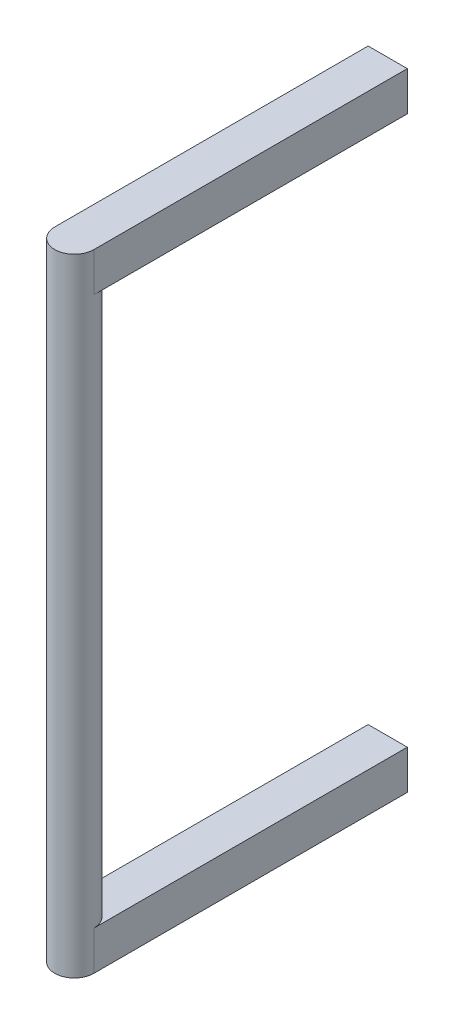
ISO-10303-21;
HEADER;
FILE_DESCRIPTION(('STEP AP214'),'2;1');
FILE_NAME('part.step','',(''),(''),'','','');
FILE_SCHEMA(('AUTOMOTIVE_DESIGN { 1 0 10303 214 1 1 1 1 }'));
ENDSEC;
DATA;
#1=APPLICATION_CONTEXT('core data for automotive mechanical design processes');
#2=APPLICATION_PROTOCOL_DEFINITION('international standard','automotive_design',2000,#1);
#3=PRODUCT_CONTEXT('',#1,'mechanical');
#4=PRODUCT('Part','Part','',(#3));
#5=PRODUCT_RELATED_PRODUCT_CATEGORY('part','',(#4));
#6=PRODUCT_DEFINITION_FORMATION('','',#4);
#7=PRODUCT_DEFINITION_CONTEXT('part definition',#1,'design');
#8=PRODUCT_DEFINITION('design','',#6,#7);
#9=PRODUCT_DEFINITION_SHAPE('','',#8);
#10=(LENGTH_UNIT() NAMED_UNIT(*) SI_UNIT(.MILLI.,.METRE.));
#11=(NAMED_UNIT(*) PLANE_ANGLE_UNIT() SI_UNIT($,.RADIAN.));
#12=(NAMED_UNIT(*) SI_UNIT($,.STERADIAN.) SOLID_ANGLE_UNIT());
#13=UNCERTAINTY_MEASURE_WITH_UNIT(LENGTH_MEASURE(1.E-05),#10,'distance_accuracy_value','');
#14=(GEOMETRIC_REPRESENTATION_CONTEXT(3) GLOBAL_UNCERTAINTY_ASSIGNED_CONTEXT((#13)) GLOBAL_UNIT_ASSIGNED_CONTEXT((#10,
#11,#12)) REPRESENTATION_CONTEXT('',''));
#15=CARTESIAN_POINT('',(0.,0.,0.));
#16=DIRECTION('',(0.,0.,1.));
#17=DIRECTION('',(1.,0.,0.));
#18=AXIS2_PLACEMENT_3D('',#15,#16,#17);
#19=CARTESIAN_POINT('',(0.,177.8,0.));
#20=DIRECTION('',(0.,-1.,0.));
#21=DIRECTION('',(0.,0.,-1.));
#22=AXIS2_PLACEMENT_3D('',#19,#20,#21);
#23=CYLINDRICAL_SURFACE('',#22,12.7);
#24=CARTESIAN_POINT('',(0.,177.8,0.));
#25=DIRECTION('',(0.,1.,0.));
#26=DIRECTION('',(0.,0.,1.));
#27=AXIS2_PLACEMENT_3D('',#24,#25,#26);
#28=CIRCLE('',#27,12.7);
#29=CARTESIAN_POINT('',(12.7,177.8,0.));
#30=VERTEX_POINT('',#29);
#31=CARTESIAN_POINT('',(-12.7,177.8,0.));
#32=VERTEX_POINT('',#31);
#33=EDGE_CURVE('E11',#30,#32,#28,.T.);
#34=ORIENTED_EDGE('',*,*,#33,.F.);
#35=DIRECTION('',(0.,-1.,0.));
#36=VECTOR('',#35,1.);
#37=CARTESIAN_POINT('',(12.7,203.2,0.));
#38=LINE('',#37,#36);
#39=CARTESIAN_POINT('',(12.7,203.2,0.));
#40=VERTEX_POINT('',#39);
#41=EDGE_CURVE('E46',#40,#30,#38,.T.);
#42=ORIENTED_EDGE('',*,*,#41,.F.);
#43=CARTESIAN_POINT('',(0.,203.2,0.));
#44=DIRECTION('',(0.,1.,0.));
#45=DIRECTION('',(0.,0.,1.));
#46=AXIS2_PLACEMENT_3D('',#43,#44,#45);
#47=CIRCLE('',#46,12.7);
#48=CARTESIAN_POINT('',(-12.7,203.2,0.));
#49=VERTEX_POINT('',#48);
#50=EDGE_CURVE('E142',#49,#40,#47,.T.);
#51=ORIENTED_EDGE('',*,*,#50,.F.);
#52=DIRECTION('',(0.,-1.,0.));
#53=VECTOR('',#52,1.);
#54=CARTESIAN_POINT('',(-12.7,203.2,0.));
#55=LINE('',#54,#53);
#56=EDGE_CURVE('E152',#49,#32,#55,.T.);
#57=ORIENTED_EDGE('',*,*,#56,.T.);
#58=EDGE_LOOP('',(#34,#42,#51,#57));
#59=FACE_BOUND('',#58,.T.);
#60=CARTESIAN_POINT('',(0.,-177.8,0.));
#61=DIRECTION('',(0.,1.,0.));
#62=DIRECTION('',(0.,0.,1.));
#63=AXIS2_PLACEMENT_3D('',#60,#61,#62);
#64=CIRCLE('',#63,12.7);
#65=CARTESIAN_POINT('',(12.7,-177.8,0.));
#66=VERTEX_POINT('',#65);
#67=CARTESIAN_POINT('',(-12.7,-177.8,0.));
#68=VERTEX_POINT('',#67);
#69=EDGE_CURVE('E107',#66,#68,#64,.T.);
#70=ORIENTED_EDGE('',*,*,#69,.T.);
#71=DIRECTION('',(0.,1.,0.));
#72=VECTOR('',#71,1.);
#73=CARTESIAN_POINT('',(-12.7,-203.2,0.));
#74=LINE('',#73,#72);
#75=CARTESIAN_POINT('',(-12.7,-203.2,0.));
#76=VERTEX_POINT('',#75);
#77=EDGE_CURVE('E102',#76,#68,#74,.T.);
#78=ORIENTED_EDGE('',*,*,#77,.F.);
#79=CARTESIAN_POINT('',(0.,-203.2,0.));
#80=DIRECTION('',(0.,1.,0.));
#81=DIRECTION('',(0.,0.,1.));
#82=AXIS2_PLACEMENT_3D('',#79,#80,#81);
#83=CIRCLE('',#82,12.7);
#84=CARTESIAN_POINT('',(12.7,-203.2,0.));
#85=VERTEX_POINT('',#84);
#86=EDGE_CURVE('E104',#76,#85,#83,.T.);
#87=ORIENTED_EDGE('',*,*,#86,.T.);
#88=DIRECTION('',(0.,1.,0.));
#89=VECTOR('',#88,1.);
#90=CARTESIAN_POINT('',(12.7,-203.2,0.));
#91=LINE('',#90,#89);
#92=EDGE_CURVE('E129',#85,#66,#91,.T.);
#93=ORIENTED_EDGE('',*,*,#92,.T.);
#94=EDGE_LOOP('',(#70,#78,#87,#93));
#95=FACE_BOUND('',#94,.T.);
#96=ADVANCED_FACE('F39',(#59,#95),#23,.T.);
#97=CARTESIAN_POINT('',(0.,177.8,0.));
#98=DIRECTION('',(0.,1.,0.));
#99=DIRECTION('',(0.,0.,1.));
#100=AXIS2_PLACEMENT_3D('',#97,#98,#99);
#101=PLANE('',#100);
#102=DIRECTION('',(0.,0.,-1.));
#103=VECTOR('',#102,1.);
#104=CARTESIAN_POINT('',(12.7,177.8,-203.2));
#105=LINE('',#104,#103);
#106=CARTESIAN_POINT('',(12.7,177.8,-203.2));
#107=VERTEX_POINT('',#106);
#108=EDGE_CURVE('E141',#30,#107,#105,.T.);
#109=ORIENTED_EDGE('',*,*,#108,.F.);
#110=ORIENTED_EDGE('',*,*,#33,.T.);
#111=DIRECTION('',(0.,0.,1.));
#112=VECTOR('',#111,1.);
#113=CARTESIAN_POINT('',(-12.7,177.8,0.));
#114=LINE('',#113,#112);
#115=CARTESIAN_POINT('',(-12.7,177.8,-203.2));
#116=VERTEX_POINT('',#115);
#117=EDGE_CURVE('E146',#116,#32,#114,.T.);
#118=ORIENTED_EDGE('',*,*,#117,.F.);
#119=DIRECTION('',(-1.,0.,0.));
#120=VECTOR('',#119,1.);
#121=CARTESIAN_POINT('',(-12.7,177.8,-203.2));
#122=LINE('',#121,#120);
#123=EDGE_CURVE('E154',#107,#116,#122,.T.);
#124=ORIENTED_EDGE('',*,*,#123,.F.);
#125=EDGE_LOOP('',(#109,#110,#118,#124));
#126=FACE_BOUND('',#125,.T.);
#127=ADVANCED_FACE('F173',(#126),#101,.F.);
#128=CARTESIAN_POINT('',(12.7,203.2,-203.2));
#129=DIRECTION('',(-1.,0.,0.));
#130=DIRECTION('',(0.,0.,1.));
#131=AXIS2_PLACEMENT_3D('',#128,#129,#130);
#132=PLANE('',#131);
#133=ORIENTED_EDGE('',*,*,#108,.T.);
#134=DIRECTION('',(0.,-1.,0.));
#135=VECTOR('',#134,1.);
#136=CARTESIAN_POINT('',(12.7,203.2,-203.2));
#137=LINE('',#136,#135);
#138=CARTESIAN_POINT('',(12.7,203.2,-203.2));
#139=VERTEX_POINT('',#138);
#140=EDGE_CURVE('E162',#139,#107,#137,.T.);
#141=ORIENTED_EDGE('',*,*,#140,.F.);
#142=DIRECTION('',(0.,0.,-1.));
#143=VECTOR('',#142,1.);
#144=CARTESIAN_POINT('',(12.7,203.2,-203.2));
#145=LINE('',#144,#143);
#146=EDGE_CURVE('E145',#40,#139,#145,.T.);
#147=ORIENTED_EDGE('',*,*,#146,.F.);
#148=ORIENTED_EDGE('',*,*,#41,.T.);
#149=EDGE_LOOP('',(#133,#141,#147,#148));
#150=FACE_BOUND('',#149,.T.);
#151=ADVANCED_FACE('F167',(#150),#132,.F.);
#152=CARTESIAN_POINT('',(-12.7,203.2,-203.2));
#153=DIRECTION('',(0.,0.,1.));
#154=DIRECTION('',(1.,0.,0.));
#155=AXIS2_PLACEMENT_3D('',#152,#153,#154);
#156=PLANE('',#155);
#157=ORIENTED_EDGE('',*,*,#123,.T.);
#158=DIRECTION('',(0.,-1.,0.));
#159=VECTOR('',#158,1.);
#160=CARTESIAN_POINT('',(-12.7,203.2,-203.2));
#161=LINE('',#160,#159);
#162=CARTESIAN_POINT('',(-12.7,203.2,-203.2));
#163=VERTEX_POINT('',#162);
#164=EDGE_CURVE('E159',#163,#116,#161,.T.);
#165=ORIENTED_EDGE('',*,*,#164,.F.);
#166=DIRECTION('',(-1.,0.,0.));
#167=VECTOR('',#166,1.);
#168=CARTESIAN_POINT('',(-12.7,203.2,-203.2));
#169=LINE('',#168,#167);
#170=EDGE_CURVE('E148',#139,#163,#169,.T.);
#171=ORIENTED_EDGE('',*,*,#170,.F.);
#172=ORIENTED_EDGE('',*,*,#140,.T.);
#173=EDGE_LOOP('',(#157,#165,#171,#172));
#174=FACE_BOUND('',#173,.T.);
#175=ADVANCED_FACE('F176',(#174),#156,.F.);
#176=CARTESIAN_POINT('',(-12.7,203.2,0.));
#177=DIRECTION('',(1.,0.,0.));
#178=DIRECTION('',(0.,0.,-1.));
#179=AXIS2_PLACEMENT_3D('',#176,#177,#178);
#180=PLANE('',#179);
#181=ORIENTED_EDGE('',*,*,#117,.T.);
#182=ORIENTED_EDGE('',*,*,#56,.F.);
#183=DIRECTION('',(0.,0.,1.));
#184=VECTOR('',#183,1.);
#185=CARTESIAN_POINT('',(-12.7,203.2,0.));
#186=LINE('',#185,#184);
#187=EDGE_CURVE('E150',#163,#49,#186,.T.);
#188=ORIENTED_EDGE('',*,*,#187,.F.);
#189=ORIENTED_EDGE('',*,*,#164,.T.);
#190=EDGE_LOOP('',(#181,#182,#188,#189));
#191=FACE_BOUND('',#190,.T.);
#192=ADVANCED_FACE('F180',(#191),#180,.F.);
#193=CARTESIAN_POINT('',(0.,203.2,0.));
#194=DIRECTION('',(0.,1.,0.));
#195=DIRECTION('',(0.,0.,1.));
#196=AXIS2_PLACEMENT_3D('',#193,#194,#195);
#197=PLANE('',#196);
#198=ORIENTED_EDGE('',*,*,#50,.T.);
#199=ORIENTED_EDGE('',*,*,#146,.T.);
#200=ORIENTED_EDGE('',*,*,#170,.T.);
#201=ORIENTED_EDGE('',*,*,#187,.T.);
#202=EDGE_LOOP('',(#198,#199,#200,#201));
#203=FACE_BOUND('',#202,.T.);
#204=ADVANCED_FACE('F182',(#203),#197,.T.);
#205=CARTESIAN_POINT('',(-12.7,-203.2,0.));
#206=DIRECTION('',(-1.,0.,0.));
#207=DIRECTION('',(0.,0.,1.));
#208=AXIS2_PLACEMENT_3D('',#205,#206,#207);
#209=PLANE('',#208);
#210=DIRECTION('',(0.,0.,1.));
#211=VECTOR('',#210,1.);
#212=CARTESIAN_POINT('',(-12.7,-177.8,0.));
#213=LINE('',#212,#211);
#214=CARTESIAN_POINT('',(-12.7,-177.8,-203.2));
#215=VERTEX_POINT('',#214);
#216=EDGE_CURVE('E130',#215,#68,#213,.T.);
#217=ORIENTED_EDGE('',*,*,#216,.F.);
#218=DIRECTION('',(0.,1.,0.));
#219=VECTOR('',#218,1.);
#220=CARTESIAN_POINT('',(-12.7,-203.2,-203.2));
#221=LINE('',#220,#219);
#222=CARTESIAN_POINT('',(-12.7,-203.2,-203.2));
#223=VERTEX_POINT('',#222);
#224=EDGE_CURVE('E112',#223,#215,#221,.T.);
#225=ORIENTED_EDGE('',*,*,#224,.F.);
#226=DIRECTION('',(0.,0.,1.));
#227=VECTOR('',#226,1.);
#228=CARTESIAN_POINT('',(-12.7,-203.2,0.));
#229=LINE('',#228,#227);
#230=EDGE_CURVE('E118',#223,#76,#229,.T.);
#231=ORIENTED_EDGE('',*,*,#230,.T.);
#232=ORIENTED_EDGE('',*,*,#77,.T.);
#233=EDGE_LOOP('',(#217,#225,#231,#232));
#234=FACE_BOUND('',#233,.T.);
#235=ADVANCED_FACE('F123',(#234),#209,.T.);
#236=CARTESIAN_POINT('',(-12.7,-203.2,-203.2));
#237=DIRECTION('',(0.,0.,-1.));
#238=DIRECTION('',(-1.,0.,0.));
#239=AXIS2_PLACEMENT_3D('',#236,#237,#238);
#240=PLANE('',#239);
#241=DIRECTION('',(-1.,0.,0.));
#242=VECTOR('',#241,1.);
#243=CARTESIAN_POINT('',(-12.7,-177.8,-203.2));
#244=LINE('',#243,#242);
#245=CARTESIAN_POINT('',(12.7,-177.8,-203.2));
#246=VERTEX_POINT('',#245);
#247=EDGE_CURVE('E132',#246,#215,#244,.T.);
#248=ORIENTED_EDGE('',*,*,#247,.F.);
#249=DIRECTION('',(0.,1.,0.));
#250=VECTOR('',#249,1.);
#251=CARTESIAN_POINT('',(12.7,-203.2,-203.2));
#252=LINE('',#251,#250);
#253=CARTESIAN_POINT('',(12.7,-203.2,-203.2));
#254=VERTEX_POINT('',#253);
#255=EDGE_CURVE('E137',#254,#246,#252,.T.);
#256=ORIENTED_EDGE('',*,*,#255,.F.);
#257=DIRECTION('',(-1.,0.,0.));
#258=VECTOR('',#257,1.);
#259=CARTESIAN_POINT('',(-12.7,-203.2,-203.2));
#260=LINE('',#259,#258);
#261=EDGE_CURVE('E124',#254,#223,#260,.T.);
#262=ORIENTED_EDGE('',*,*,#261,.T.);
#263=ORIENTED_EDGE('',*,*,#224,.T.);
#264=EDGE_LOOP('',(#248,#256,#262,#263));
#265=FACE_BOUND('',#264,.T.);
#266=ADVANCED_FACE('F190',(#265),#240,.T.);
#267=CARTESIAN_POINT('',(12.7,-203.2,-203.2));
#268=DIRECTION('',(1.,0.,0.));
#269=DIRECTION('',(0.,0.,-1.));
#270=AXIS2_PLACEMENT_3D('',#267,#268,#269);
#271=PLANE('',#270);
#272=DIRECTION('',(0.,0.,-1.));
#273=VECTOR('',#272,1.);
#274=CARTESIAN_POINT('',(12.7,-177.8,-203.2));
#275=LINE('',#274,#273);
#276=EDGE_CURVE('E53',#66,#246,#275,.T.);
#277=ORIENTED_EDGE('',*,*,#276,.F.);
#278=ORIENTED_EDGE('',*,*,#92,.F.);
#279=DIRECTION('',(0.,0.,-1.));
#280=VECTOR('',#279,1.);
#281=CARTESIAN_POINT('',(12.7,-203.2,-203.2));
#282=LINE('',#281,#280);
#283=EDGE_CURVE('E121',#85,#254,#282,.T.);
#284=ORIENTED_EDGE('',*,*,#283,.T.);
#285=ORIENTED_EDGE('',*,*,#255,.T.);
#286=EDGE_LOOP('',(#277,#278,#284,#285));
#287=FACE_BOUND('',#286,.T.);
#288=ADVANCED_FACE('F240',(#287),#271,.T.);
#289=CARTESIAN_POINT('',(0.,-203.2,0.));
#290=DIRECTION('',(0.,-1.,0.));
#291=DIRECTION('',(0.,0.,1.));
#292=AXIS2_PLACEMENT_3D('',#289,#290,#291);
#293=PLANE('',#292);
#294=ORIENTED_EDGE('',*,*,#86,.F.);
#295=ORIENTED_EDGE('',*,*,#230,.F.);
#296=ORIENTED_EDGE('',*,*,#261,.F.);
#297=ORIENTED_EDGE('',*,*,#283,.F.);
#298=EDGE_LOOP('',(#294,#295,#296,#297));
#299=FACE_BOUND('',#298,.T.);
#300=ADVANCED_FACE('F116',(#299),#293,.T.);
#301=CARTESIAN_POINT('',(0.,-177.8,0.));
#302=DIRECTION('',(0.,-1.,0.));
#303=DIRECTION('',(0.,0.,1.));
#304=AXIS2_PLACEMENT_3D('',#301,#302,#303);
#305=PLANE('',#304);
#306=ORIENTED_EDGE('',*,*,#69,.F.);
#307=ORIENTED_EDGE('',*,*,#276,.T.);
#308=ORIENTED_EDGE('',*,*,#247,.T.);
#309=ORIENTED_EDGE('',*,*,#216,.T.);
#310=EDGE_LOOP('',(#306,#307,#308,#309));
#311=FACE_BOUND('',#310,.T.);
#312=ADVANCED_FACE('F258',(#311),#305,.F.);
#313=CLOSED_SHELL('',(#96,#127,#151,#175,#192,#204,#235,#266,#288,#300,#312));
#314=MANIFOLD_SOLID_BREP('B2',#313);
#315=ADVANCED_BREP_SHAPE_REPRESENTATION('',(#18,#314),#14);
#316=SHAPE_DEFINITION_REPRESENTATION(#9,#315);
ENDSEC;
END-ISO-10303-21;
